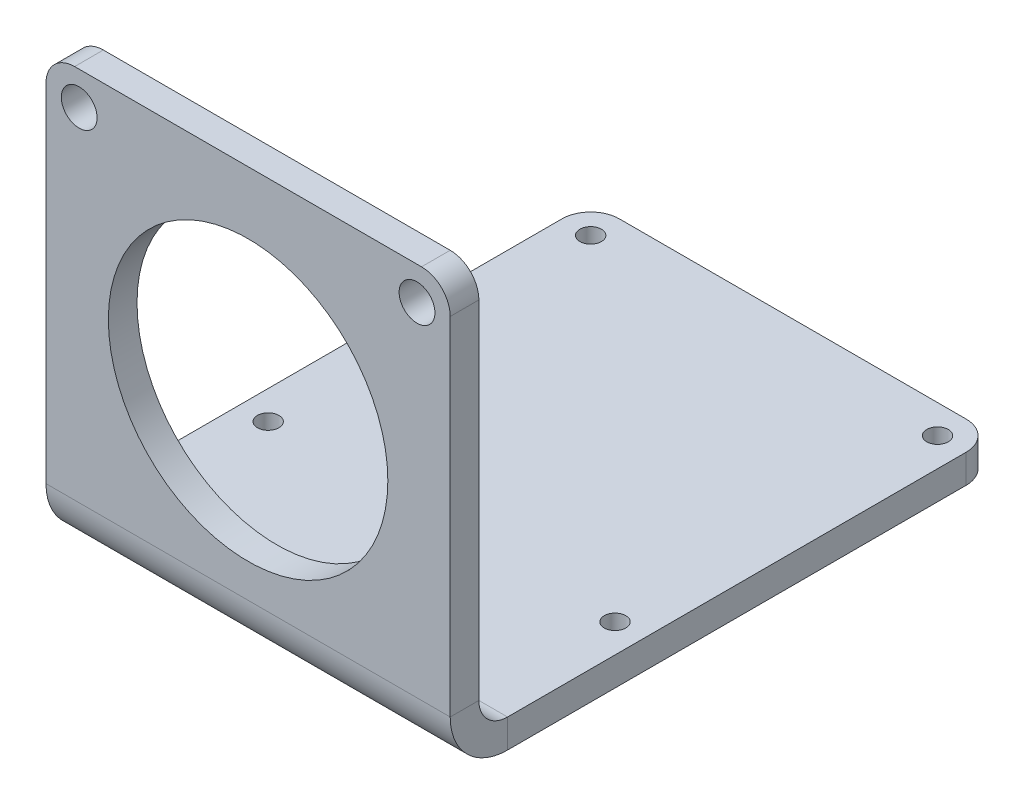
ISO-10303-21;
HEADER;
FILE_DESCRIPTION(('STEP AP214'),'2;1');
FILE_NAME('part.step','',(''),(''),'','','');
FILE_SCHEMA(('AUTOMOTIVE_DESIGN { 1 0 10303 214 1 1 1 1 }'));
ENDSEC;
DATA;
#1=APPLICATION_CONTEXT('core data for automotive mechanical design processes');
#2=APPLICATION_PROTOCOL_DEFINITION('international standard','automotive_design',2000,#1);
#3=PRODUCT_CONTEXT('',#1,'mechanical');
#4=PRODUCT('Part','Part','',(#3));
#5=PRODUCT_RELATED_PRODUCT_CATEGORY('part','',(#4));
#6=PRODUCT_DEFINITION_FORMATION('','',#4);
#7=PRODUCT_DEFINITION_CONTEXT('part definition',#1,'design');
#8=PRODUCT_DEFINITION('design','',#6,#7);
#9=PRODUCT_DEFINITION_SHAPE('','',#8);
#10=(LENGTH_UNIT() NAMED_UNIT(*) SI_UNIT(.MILLI.,.METRE.));
#11=(NAMED_UNIT(*) PLANE_ANGLE_UNIT() SI_UNIT($,.RADIAN.));
#12=(NAMED_UNIT(*) SI_UNIT($,.STERADIAN.) SOLID_ANGLE_UNIT());
#13=UNCERTAINTY_MEASURE_WITH_UNIT(LENGTH_MEASURE(1.E-05),#10,'distance_accuracy_value','');
#14=(GEOMETRIC_REPRESENTATION_CONTEXT(3) GLOBAL_UNCERTAINTY_ASSIGNED_CONTEXT((#13)) GLOBAL_UNIT_ASSIGNED_CONTEXT((#10,
#11,#12)) REPRESENTATION_CONTEXT('',''));
#15=CARTESIAN_POINT('',(0.,0.,0.));
#16=DIRECTION('',(0.,0.,1.));
#17=DIRECTION('',(1.,0.,0.));
#18=AXIS2_PLACEMENT_3D('',#15,#16,#17);
#19=CARTESIAN_POINT('',(28.2,-28.2,4.));
#20=DIRECTION('',(-1.,0.,0.));
#21=DIRECTION('',(0.,0.,1.));
#22=AXIS2_PLACEMENT_3D('',#19,#20,#21);
#23=PLANE('',#22);
#24=DIRECTION('',(0.,1.,0.));
#25=VECTOR('',#24,1.);
#26=CARTESIAN_POINT('',(28.2,-28.2,-4.));
#27=LINE('',#26,#25);
#28=CARTESIAN_POINT('',(28.2,-32.2,-4.));
#29=VERTEX_POINT('',#28);
#30=CARTESIAN_POINT('',(28.2,-28.2,-4.));
#31=VERTEX_POINT('',#30);
#32=EDGE_CURVE('E13',#29,#31,#27,.T.);
#33=ORIENTED_EDGE('',*,*,#32,.F.);
#34=DIRECTION('',(0.,0.,1.));
#35=VECTOR('',#34,1.);
#36=CARTESIAN_POINT('',(28.2,-32.2,4.));
#37=LINE('',#36,#35);
#38=CARTESIAN_POINT('',(28.2,-32.2,-68.));
#39=VERTEX_POINT('',#38);
#40=EDGE_CURVE('E115',#39,#29,#37,.T.);
#41=ORIENTED_EDGE('',*,*,#40,.F.);
#42=DIRECTION('',(0.,1.,0.));
#43=VECTOR('',#42,1.);
#44=CARTESIAN_POINT('',(28.2,-28.2,-68.));
#45=LINE('',#44,#43);
#46=CARTESIAN_POINT('',(28.2,-28.2,-68.));
#47=VERTEX_POINT('',#46);
#48=EDGE_CURVE('E63',#39,#47,#45,.T.);
#49=ORIENTED_EDGE('',*,*,#48,.T.);
#50=DIRECTION('',(0.,0.,1.));
#51=VECTOR('',#50,1.);
#52=CARTESIAN_POINT('',(28.2,-28.2,4.));
#53=LINE('',#52,#51);
#54=EDGE_CURVE('E118',#47,#31,#53,.T.);
#55=ORIENTED_EDGE('',*,*,#54,.T.);
#56=EDGE_LOOP('',(#33,#41,#49,#55));
#57=FACE_BOUND('',#56,.T.);
#58=ADVANCED_FACE('F52',(#57),#23,.F.);
#59=CARTESIAN_POINT('',(24.2,-28.2,-68.));
#60=DIRECTION('',(0.,1.,0.));
#61=DIRECTION('',(0.,0.,1.));
#62=AXIS2_PLACEMENT_3D('',#59,#60,#61);
#63=CYLINDRICAL_SURFACE('',#62,4.);
#64=ORIENTED_EDGE('',*,*,#48,.F.);
#65=CARTESIAN_POINT('',(24.2,-32.2,-68.));
#66=DIRECTION('',(0.,1.,0.));
#67=DIRECTION('',(0.,0.,1.));
#68=AXIS2_PLACEMENT_3D('',#65,#66,#67);
#69=CIRCLE('',#68,4.);
#70=CARTESIAN_POINT('',(24.2,-32.2,-72.));
#71=VERTEX_POINT('',#70);
#72=EDGE_CURVE('E145',#39,#71,#69,.T.);
#73=ORIENTED_EDGE('',*,*,#72,.T.);
#74=DIRECTION('',(0.,1.,0.));
#75=VECTOR('',#74,1.);
#76=CARTESIAN_POINT('',(24.2,-28.2,-72.));
#77=LINE('',#76,#75);
#78=CARTESIAN_POINT('',(24.2,-28.2,-72.));
#79=VERTEX_POINT('',#78);
#80=EDGE_CURVE('E204',#71,#79,#77,.T.);
#81=ORIENTED_EDGE('',*,*,#80,.T.);
#82=CARTESIAN_POINT('',(24.2,-28.2,-68.));
#83=DIRECTION('',(0.,1.,0.));
#84=DIRECTION('',(0.,0.,1.));
#85=AXIS2_PLACEMENT_3D('',#82,#83,#84);
#86=CIRCLE('',#85,4.);
#87=EDGE_CURVE('E219',#47,#79,#86,.T.);
#88=ORIENTED_EDGE('',*,*,#87,.F.);
#89=EDGE_LOOP('',(#64,#73,#81,#88));
#90=FACE_BOUND('',#89,.T.);
#91=ADVANCED_FACE('F226',(#90),#63,.T.);
#92=CARTESIAN_POINT('',(-28.2,-28.2,-72.));
#93=DIRECTION('',(0.,0.,1.));
#94=DIRECTION('',(1.,0.,0.));
#95=AXIS2_PLACEMENT_3D('',#92,#93,#94);
#96=PLANE('',#95);
#97=ORIENTED_EDGE('',*,*,#80,.F.);
#98=DIRECTION('',(1.,0.,0.));
#99=VECTOR('',#98,1.);
#100=CARTESIAN_POINT('',(-28.2,-32.2,-72.));
#101=LINE('',#100,#99);
#102=CARTESIAN_POINT('',(-24.2,-32.2,-72.));
#103=VERTEX_POINT('',#102);
#104=EDGE_CURVE('E327',#103,#71,#101,.T.);
#105=ORIENTED_EDGE('',*,*,#104,.F.);
#106=DIRECTION('',(0.,1.,0.));
#107=VECTOR('',#106,1.);
#108=CARTESIAN_POINT('',(-24.2,-28.2,-72.));
#109=LINE('',#108,#107);
#110=CARTESIAN_POINT('',(-24.2,-28.2,-72.));
#111=VERTEX_POINT('',#110);
#112=EDGE_CURVE('E200',#103,#111,#109,.T.);
#113=ORIENTED_EDGE('',*,*,#112,.T.);
#114=DIRECTION('',(1.,0.,0.));
#115=VECTOR('',#114,1.);
#116=CARTESIAN_POINT('',(-28.2,-28.2,-72.));
#117=LINE('',#116,#115);
#118=EDGE_CURVE('E228',#111,#79,#117,.T.);
#119=ORIENTED_EDGE('',*,*,#118,.T.);
#120=EDGE_LOOP('',(#97,#105,#113,#119));
#121=FACE_BOUND('',#120,.T.);
#122=ADVANCED_FACE('F395',(#121),#96,.F.);
#123=CARTESIAN_POINT('',(-24.2,-28.2,-68.));
#124=DIRECTION('',(0.,1.,0.));
#125=DIRECTION('',(0.,0.,1.));
#126=AXIS2_PLACEMENT_3D('',#123,#124,#125);
#127=CYLINDRICAL_SURFACE('',#126,4.);
#128=ORIENTED_EDGE('',*,*,#112,.F.);
#129=CARTESIAN_POINT('',(-24.2,-32.2,-68.));
#130=DIRECTION('',(0.,1.,0.));
#131=DIRECTION('',(0.,0.,1.));
#132=AXIS2_PLACEMENT_3D('',#129,#130,#131);
#133=CIRCLE('',#132,4.);
#134=CARTESIAN_POINT('',(-28.2,-32.2,-68.));
#135=VERTEX_POINT('',#134);
#136=EDGE_CURVE('E323',#103,#135,#133,.T.);
#137=ORIENTED_EDGE('',*,*,#136,.T.);
#138=DIRECTION('',(0.,1.,0.));
#139=VECTOR('',#138,1.);
#140=CARTESIAN_POINT('',(-28.2,-28.2,-68.));
#141=LINE('',#140,#139);
#142=CARTESIAN_POINT('',(-28.2,-28.2,-68.));
#143=VERTEX_POINT('',#142);
#144=EDGE_CURVE('E196',#135,#143,#141,.T.);
#145=ORIENTED_EDGE('',*,*,#144,.T.);
#146=CARTESIAN_POINT('',(-24.2,-28.2,-68.));
#147=DIRECTION('',(0.,1.,0.));
#148=DIRECTION('',(0.,0.,1.));
#149=AXIS2_PLACEMENT_3D('',#146,#147,#148);
#150=CIRCLE('',#149,4.);
#151=EDGE_CURVE('E232',#111,#143,#150,.T.);
#152=ORIENTED_EDGE('',*,*,#151,.F.);
#153=EDGE_LOOP('',(#128,#137,#145,#152));
#154=FACE_BOUND('',#153,.T.);
#155=ADVANCED_FACE('F470',(#154),#127,.T.);
#156=CARTESIAN_POINT('',(-28.2,-28.2,4.));
#157=DIRECTION('',(-1.,0.,0.));
#158=DIRECTION('',(0.,0.,1.));
#159=AXIS2_PLACEMENT_3D('',#156,#157,#158);
#160=PLANE('',#159);
#161=ORIENTED_EDGE('',*,*,#144,.F.);
#162=DIRECTION('',(0.,0.,1.));
#163=VECTOR('',#162,1.);
#164=CARTESIAN_POINT('',(-28.2,-32.2,4.));
#165=LINE('',#164,#163);
#166=CARTESIAN_POINT('',(-28.2,-32.2,-4.));
#167=VERTEX_POINT('',#166);
#168=EDGE_CURVE('E294',#135,#167,#165,.T.);
#169=ORIENTED_EDGE('',*,*,#168,.T.);
#170=DIRECTION('',(0.,1.,0.));
#171=VECTOR('',#170,1.);
#172=CARTESIAN_POINT('',(-28.2,-28.2,-4.));
#173=LINE('',#172,#171);
#174=CARTESIAN_POINT('',(-28.2,-28.2,-4.));
#175=VERTEX_POINT('',#174);
#176=EDGE_CURVE('E192',#167,#175,#173,.T.);
#177=ORIENTED_EDGE('',*,*,#176,.T.);
#178=DIRECTION('',(0.,0.,1.));
#179=VECTOR('',#178,1.);
#180=CARTESIAN_POINT('',(-28.2,-28.2,4.));
#181=LINE('',#180,#179);
#182=EDGE_CURVE('E239',#143,#175,#181,.T.);
#183=ORIENTED_EDGE('',*,*,#182,.F.);
#184=EDGE_LOOP('',(#161,#169,#177,#183));
#185=FACE_BOUND('',#184,.T.);
#186=ADVANCED_FACE('F467',(#185),#160,.T.);
#187=CARTESIAN_POINT('',(-28.2,-24.2,-4.));
#188=DIRECTION('',(1.,0.,0.));
#189=DIRECTION('',(0.,0.,-1.));
#190=AXIS2_PLACEMENT_3D('',#187,#188,#189);
#191=PLANE('',#190);
#192=ORIENTED_EDGE('',*,*,#176,.F.);
#193=CARTESIAN_POINT('',(-28.2,-24.2,-4.));
#194=DIRECTION('',(1.,0.,0.));
#195=DIRECTION('',(0.,0.,-1.));
#196=AXIS2_PLACEMENT_3D('',#193,#194,#195);
#197=CIRCLE('',#196,8.);
#198=CARTESIAN_POINT('',(-28.2,-24.2,4.));
#199=VERTEX_POINT('',#198);
#200=EDGE_CURVE('E133',#167,#199,#197,.F.);
#201=ORIENTED_EDGE('',*,*,#200,.T.);
#202=DIRECTION('',(0.,0.,-1.));
#203=VECTOR('',#202,1.);
#204=CARTESIAN_POINT('',(-28.2,-24.2,0.));
#205=LINE('',#204,#203);
#206=CARTESIAN_POINT('',(-28.2,-24.2,0.));
#207=VERTEX_POINT('',#206);
#208=EDGE_CURVE('E71',#199,#207,#205,.T.);
#209=ORIENTED_EDGE('',*,*,#208,.T.);
#210=CARTESIAN_POINT('',(-28.2,-24.2,-4.));
#211=DIRECTION('',(-1.,0.,0.));
#212=DIRECTION('',(0.,0.,1.));
#213=AXIS2_PLACEMENT_3D('',#210,#211,#212);
#214=CIRCLE('',#213,4.);
#215=EDGE_CURVE('E283',#175,#207,#214,.T.);
#216=ORIENTED_EDGE('',*,*,#215,.F.);
#217=EDGE_LOOP('',(#192,#201,#209,#216));
#218=FACE_BOUND('',#217,.T.);
#219=ADVANCED_FACE('F463',(#218),#191,.F.);
#220=CARTESIAN_POINT('',(-28.2,-28.2,0.));
#221=DIRECTION('',(-1.,0.,0.));
#222=DIRECTION('',(0.,-1.,0.));
#223=AXIS2_PLACEMENT_3D('',#220,#221,#222);
#224=PLANE('',#223);
#225=ORIENTED_EDGE('',*,*,#208,.F.);
#226=DIRECTION('',(0.,1.,0.));
#227=VECTOR('',#226,1.);
#228=CARTESIAN_POINT('',(-28.2,24.2,4.));
#229=LINE('',#228,#227);
#230=CARTESIAN_POINT('',(-28.2,24.2,4.));
#231=VERTEX_POINT('',#230);
#232=EDGE_CURVE('E306',#231,#199,#229,.F.);
#233=ORIENTED_EDGE('',*,*,#232,.F.);
#234=DIRECTION('',(0.,0.,-1.));
#235=VECTOR('',#234,1.);
#236=CARTESIAN_POINT('',(-28.2,24.2,0.));
#237=LINE('',#236,#235);
#238=CARTESIAN_POINT('',(-28.2,24.2,0.));
#239=VERTEX_POINT('',#238);
#240=EDGE_CURVE('E186',#231,#239,#237,.T.);
#241=ORIENTED_EDGE('',*,*,#240,.T.);
#242=DIRECTION('',(0.,-1.,0.));
#243=VECTOR('',#242,1.);
#244=CARTESIAN_POINT('',(-28.2,-28.2,0.));
#245=LINE('',#244,#243);
#246=EDGE_CURVE('E258',#239,#207,#245,.T.);
#247=ORIENTED_EDGE('',*,*,#246,.T.);
#248=EDGE_LOOP('',(#225,#233,#241,#247));
#249=FACE_BOUND('',#248,.T.);
#250=ADVANCED_FACE('F459',(#249),#224,.T.);
#251=CARTESIAN_POINT('',(-24.2,24.2,0.));
#252=DIRECTION('',(0.,0.,1.));
#253=DIRECTION('',(1.,0.,0.));
#254=AXIS2_PLACEMENT_3D('',#251,#252,#253);
#255=CYLINDRICAL_SURFACE('',#254,4.);
#256=ORIENTED_EDGE('',*,*,#240,.F.);
#257=CARTESIAN_POINT('',(-24.2,24.2,4.));
#258=DIRECTION('',(0.,0.,1.));
#259=DIRECTION('',(1.,0.,0.));
#260=AXIS2_PLACEMENT_3D('',#257,#258,#259);
#261=CIRCLE('',#260,4.);
#262=CARTESIAN_POINT('',(-24.2,28.2,4.));
#263=VERTEX_POINT('',#262);
#264=EDGE_CURVE('E314',#263,#231,#261,.T.);
#265=ORIENTED_EDGE('',*,*,#264,.F.);
#266=DIRECTION('',(0.,0.,-1.));
#267=VECTOR('',#266,1.);
#268=CARTESIAN_POINT('',(-24.2,28.2,0.));
#269=LINE('',#268,#267);
#270=CARTESIAN_POINT('',(-24.2,28.2,0.));
#271=VERTEX_POINT('',#270);
#272=EDGE_CURVE('E182',#263,#271,#269,.T.);
#273=ORIENTED_EDGE('',*,*,#272,.T.);
#274=CARTESIAN_POINT('',(-24.2,24.2,0.));
#275=DIRECTION('',(0.,0.,1.));
#276=DIRECTION('',(1.,0.,0.));
#277=AXIS2_PLACEMENT_3D('',#274,#275,#276);
#278=CIRCLE('',#277,4.);
#279=EDGE_CURVE('E262',#271,#239,#278,.T.);
#280=ORIENTED_EDGE('',*,*,#279,.T.);
#281=EDGE_LOOP('',(#256,#265,#273,#280));
#282=FACE_BOUND('',#281,.T.);
#283=ADVANCED_FACE('F455',(#282),#255,.T.);
#284=CARTESIAN_POINT('',(24.2,28.2,0.));
#285=DIRECTION('',(0.,1.,0.));
#286=DIRECTION('',(-1.,0.,0.));
#287=AXIS2_PLACEMENT_3D('',#284,#285,#286);
#288=PLANE('',#287);
#289=ORIENTED_EDGE('',*,*,#272,.F.);
#290=DIRECTION('',(1.,0.,0.));
#291=VECTOR('',#290,1.);
#292=CARTESIAN_POINT('',(24.2,28.2,4.));
#293=LINE('',#292,#291);
#294=CARTESIAN_POINT('',(24.2,28.2,4.));
#295=VERTEX_POINT('',#294);
#296=EDGE_CURVE('E310',#295,#263,#293,.F.);
#297=ORIENTED_EDGE('',*,*,#296,.F.);
#298=DIRECTION('',(0.,0.,-1.));
#299=VECTOR('',#298,1.);
#300=CARTESIAN_POINT('',(24.2,28.2,0.));
#301=LINE('',#300,#299);
#302=CARTESIAN_POINT('',(24.2,28.2,0.));
#303=VERTEX_POINT('',#302);
#304=EDGE_CURVE('E178',#295,#303,#301,.T.);
#305=ORIENTED_EDGE('',*,*,#304,.T.);
#306=DIRECTION('',(-1.,0.,0.));
#307=VECTOR('',#306,1.);
#308=CARTESIAN_POINT('',(24.2,28.2,0.));
#309=LINE('',#308,#307);
#310=EDGE_CURVE('E266',#303,#271,#309,.T.);
#311=ORIENTED_EDGE('',*,*,#310,.T.);
#312=EDGE_LOOP('',(#289,#297,#305,#311));
#313=FACE_BOUND('',#312,.T.);
#314=ADVANCED_FACE('F451',(#313),#288,.T.);
#315=CARTESIAN_POINT('',(24.2,24.2,0.));
#316=DIRECTION('',(0.,0.,1.));
#317=DIRECTION('',(1.,0.,0.));
#318=AXIS2_PLACEMENT_3D('',#315,#316,#317);
#319=CYLINDRICAL_SURFACE('',#318,4.);
#320=ORIENTED_EDGE('',*,*,#304,.F.);
#321=CARTESIAN_POINT('',(24.2,24.2,4.));
#322=DIRECTION('',(0.,0.,1.));
#323=DIRECTION('',(1.,0.,0.));
#324=AXIS2_PLACEMENT_3D('',#321,#322,#323);
#325=CIRCLE('',#324,4.);
#326=CARTESIAN_POINT('',(28.2,24.2,4.));
#327=VERTEX_POINT('',#326);
#328=EDGE_CURVE('E139',#327,#295,#325,.T.);
#329=ORIENTED_EDGE('',*,*,#328,.F.);
#330=DIRECTION('',(0.,0.,-1.));
#331=VECTOR('',#330,1.);
#332=CARTESIAN_POINT('',(28.2,24.2,0.));
#333=LINE('',#332,#331);
#334=CARTESIAN_POINT('',(28.2,24.2,0.));
#335=VERTEX_POINT('',#334);
#336=EDGE_CURVE('E174',#327,#335,#333,.T.);
#337=ORIENTED_EDGE('',*,*,#336,.T.);
#338=CARTESIAN_POINT('',(24.2,24.2,0.));
#339=DIRECTION('',(0.,0.,1.));
#340=DIRECTION('',(1.,0.,0.));
#341=AXIS2_PLACEMENT_3D('',#338,#339,#340);
#342=CIRCLE('',#341,4.);
#343=EDGE_CURVE('E270',#335,#303,#342,.T.);
#344=ORIENTED_EDGE('',*,*,#343,.T.);
#345=EDGE_LOOP('',(#320,#329,#337,#344));
#346=FACE_BOUND('',#345,.T.);
#347=ADVANCED_FACE('F447',(#346),#319,.T.);
#348=CARTESIAN_POINT('',(28.2,-28.2,0.));
#349=DIRECTION('',(1.,0.,0.));
#350=DIRECTION('',(0.,1.,0.));
#351=AXIS2_PLACEMENT_3D('',#348,#349,#350);
#352=PLANE('',#351);
#353=ORIENTED_EDGE('',*,*,#336,.F.);
#354=DIRECTION('',(0.,1.,0.));
#355=VECTOR('',#354,1.);
#356=CARTESIAN_POINT('',(28.2,24.2,4.));
#357=LINE('',#356,#355);
#358=CARTESIAN_POINT('',(28.2,-24.2,4.));
#359=VERTEX_POINT('',#358);
#360=EDGE_CURVE('E302',#359,#327,#357,.T.);
#361=ORIENTED_EDGE('',*,*,#360,.F.);
#362=DIRECTION('',(0.,0.,-1.));
#363=VECTOR('',#362,1.);
#364=CARTESIAN_POINT('',(28.2,-24.2,0.));
#365=LINE('',#364,#363);
#366=CARTESIAN_POINT('',(28.2,-24.2,0.));
#367=VERTEX_POINT('',#366);
#368=EDGE_CURVE('E56',#359,#367,#365,.T.);
#369=ORIENTED_EDGE('',*,*,#368,.T.);
#370=DIRECTION('',(0.,1.,0.));
#371=VECTOR('',#370,1.);
#372=CARTESIAN_POINT('',(28.2,-28.2,0.));
#373=LINE('',#372,#371);
#374=EDGE_CURVE('E254',#367,#335,#373,.T.);
#375=ORIENTED_EDGE('',*,*,#374,.T.);
#376=EDGE_LOOP('',(#353,#361,#369,#375));
#377=FACE_BOUND('',#376,.T.);
#378=ADVANCED_FACE('F406',(#377),#352,.T.);
#379=CARTESIAN_POINT('',(24.2,-28.2,-68.));
#380=DIRECTION('',(0.,1.,0.));
#381=DIRECTION('',(0.,0.,1.));
#382=AXIS2_PLACEMENT_3D('',#379,#380,#381);
#383=CYLINDRICAL_SURFACE('',#382,1.5);
#384=CARTESIAN_POINT('',(24.2,-28.2,-68.));
#385=DIRECTION('',(0.,1.,0.));
#386=DIRECTION('',(0.,0.,1.));
#387=AXIS2_PLACEMENT_3D('',#384,#385,#386);
#388=CIRCLE('',#387,1.5);
#389=CARTESIAN_POINT('',(24.2,-28.2,-66.5));
#390=VERTEX_POINT('',#389);
#391=EDGE_CURVE('E286',#390,#390,#388,.T.);
#392=ORIENTED_EDGE('',*,*,#391,.T.);
#393=EDGE_LOOP('',(#392));
#394=FACE_BOUND('',#393,.T.);
#395=CARTESIAN_POINT('',(24.2,-32.2,-68.));
#396=DIRECTION('',(0.,1.,0.));
#397=DIRECTION('',(0.,0.,1.));
#398=AXIS2_PLACEMENT_3D('',#395,#396,#397);
#399=CIRCLE('',#398,1.5);
#400=CARTESIAN_POINT('',(24.2,-32.2,-66.5));
#401=VERTEX_POINT('',#400);
#402=EDGE_CURVE('E156',#401,#401,#399,.T.);
#403=ORIENTED_EDGE('',*,*,#402,.F.);
#404=EDGE_LOOP('',(#403));
#405=FACE_BOUND('',#404,.T.);
#406=ADVANCED_FACE('F402',(#394,#405),#383,.F.);
#407=CARTESIAN_POINT('',(-24.2,-28.2,-23.));
#408=DIRECTION('',(0.,1.,0.));
#409=DIRECTION('',(0.,0.,1.));
#410=AXIS2_PLACEMENT_3D('',#407,#408,#409);
#411=CYLINDRICAL_SURFACE('',#410,1.5);
#412=CARTESIAN_POINT('',(-24.2,-28.2,-23.));
#413=DIRECTION('',(0.,1.,0.));
#414=DIRECTION('',(0.,0.,1.));
#415=AXIS2_PLACEMENT_3D('',#412,#413,#414);
#416=CIRCLE('',#415,1.5);
#417=CARTESIAN_POINT('',(-24.2,-28.2,-21.5));
#418=VERTEX_POINT('',#417);
#419=EDGE_CURVE('E356',#418,#418,#416,.T.);
#420=ORIENTED_EDGE('',*,*,#419,.T.);
#421=EDGE_LOOP('',(#420));
#422=FACE_BOUND('',#421,.T.);
#423=CARTESIAN_POINT('',(-24.2,-32.2,-23.));
#424=DIRECTION('',(0.,1.,0.));
#425=DIRECTION('',(0.,0.,1.));
#426=AXIS2_PLACEMENT_3D('',#423,#424,#425);
#427=CIRCLE('',#426,1.5);
#428=CARTESIAN_POINT('',(-24.2,-32.2,-21.5));
#429=VERTEX_POINT('',#428);
#430=EDGE_CURVE('E163',#429,#429,#427,.T.);
#431=ORIENTED_EDGE('',*,*,#430,.F.);
#432=EDGE_LOOP('',(#431));
#433=FACE_BOUND('',#432,.T.);
#434=ADVANCED_FACE('F405',(#422,#433),#411,.F.);
#435=CARTESIAN_POINT('',(24.2,-28.2,-23.));
#436=DIRECTION('',(0.,1.,0.));
#437=DIRECTION('',(0.,0.,1.));
#438=AXIS2_PLACEMENT_3D('',#435,#436,#437);
#439=CYLINDRICAL_SURFACE('',#438,1.5);
#440=CARTESIAN_POINT('',(24.2,-28.2,-23.));
#441=DIRECTION('',(0.,1.,0.));
#442=DIRECTION('',(0.,0.,1.));
#443=AXIS2_PLACEMENT_3D('',#440,#441,#442);
#444=CIRCLE('',#443,1.5);
#445=CARTESIAN_POINT('',(24.2,-28.2,-21.5));
#446=VERTEX_POINT('',#445);
#447=EDGE_CURVE('E361',#446,#446,#444,.T.);
#448=ORIENTED_EDGE('',*,*,#447,.T.);
#449=EDGE_LOOP('',(#448));
#450=FACE_BOUND('',#449,.T.);
#451=CARTESIAN_POINT('',(24.2,-32.2,-23.));
#452=DIRECTION('',(0.,1.,0.));
#453=DIRECTION('',(0.,0.,1.));
#454=AXIS2_PLACEMENT_3D('',#451,#452,#453);
#455=CIRCLE('',#454,1.5);
#456=CARTESIAN_POINT('',(24.2,-32.2,-21.5));
#457=VERTEX_POINT('',#456);
#458=EDGE_CURVE('E167',#457,#457,#455,.T.);
#459=ORIENTED_EDGE('',*,*,#458,.F.);
#460=EDGE_LOOP('',(#459));
#461=FACE_BOUND('',#460,.T.);
#462=ADVANCED_FACE('F409',(#450,#461),#439,.F.);
#463=CARTESIAN_POINT('',(-24.2,-28.2,-68.));
#464=DIRECTION('',(0.,1.,0.));
#465=DIRECTION('',(0.,0.,1.));
#466=AXIS2_PLACEMENT_3D('',#463,#464,#465);
#467=CYLINDRICAL_SURFACE('',#466,1.5);
#468=CARTESIAN_POINT('',(-24.2,-28.2,-68.));
#469=DIRECTION('',(0.,1.,0.));
#470=DIRECTION('',(0.,0.,1.));
#471=AXIS2_PLACEMENT_3D('',#468,#469,#470);
#472=CIRCLE('',#471,1.5);
#473=CARTESIAN_POINT('',(-24.2,-28.2,-66.5));
#474=VERTEX_POINT('',#473);
#475=EDGE_CURVE('E224',#474,#474,#472,.T.);
#476=ORIENTED_EDGE('',*,*,#475,.T.);
#477=EDGE_LOOP('',(#476));
#478=FACE_BOUND('',#477,.T.);
#479=CARTESIAN_POINT('',(-24.2,-32.2,-68.));
#480=DIRECTION('',(0.,1.,0.));
#481=DIRECTION('',(0.,0.,1.));
#482=AXIS2_PLACEMENT_3D('',#479,#480,#481);
#483=CIRCLE('',#482,1.5);
#484=CARTESIAN_POINT('',(-24.2,-32.2,-66.5));
#485=VERTEX_POINT('',#484);
#486=EDGE_CURVE('E147',#485,#485,#483,.T.);
#487=ORIENTED_EDGE('',*,*,#486,.F.);
#488=EDGE_LOOP('',(#487));
#489=FACE_BOUND('',#488,.T.);
#490=ADVANCED_FACE('F54',(#478,#489),#467,.F.);
#491=CARTESIAN_POINT('',(-23.57,23.57,0.));
#492=DIRECTION('',(0.,0.,1.));
#493=DIRECTION('',(1.,0.,0.));
#494=AXIS2_PLACEMENT_3D('',#491,#492,#493);
#495=CYLINDRICAL_SURFACE('',#494,2.5);
#496=CARTESIAN_POINT('',(-23.57,23.57,0.));
#497=DIRECTION('',(0.,0.,1.));
#498=DIRECTION('',(1.,0.,0.));
#499=AXIS2_PLACEMENT_3D('',#496,#497,#498);
#500=CIRCLE('',#499,2.5);
#501=CARTESIAN_POINT('',(-21.07,23.57,0.));
#502=VERTEX_POINT('',#501);
#503=EDGE_CURVE('E242',#502,#502,#500,.T.);
#504=ORIENTED_EDGE('',*,*,#503,.F.);
#505=EDGE_LOOP('',(#504));
#506=FACE_BOUND('',#505,.T.);
#507=CARTESIAN_POINT('',(-23.57,23.57,4.));
#508=DIRECTION('',(0.,0.,1.));
#509=DIRECTION('',(1.,0.,0.));
#510=AXIS2_PLACEMENT_3D('',#507,#508,#509);
#511=CIRCLE('',#510,2.5);
#512=CARTESIAN_POINT('',(-21.07,23.57,4.));
#513=VERTEX_POINT('',#512);
#514=EDGE_CURVE('E289',#513,#513,#511,.T.);
#515=ORIENTED_EDGE('',*,*,#514,.T.);
#516=EDGE_LOOP('',(#515));
#517=FACE_BOUND('',#516,.T.);
#518=ADVANCED_FACE('F416',(#506,#517),#495,.F.);
#519=CARTESIAN_POINT('',(23.57,23.57,0.));
#520=DIRECTION('',(0.,0.,1.));
#521=DIRECTION('',(1.,0.,0.));
#522=AXIS2_PLACEMENT_3D('',#519,#520,#521);
#523=CYLINDRICAL_SURFACE('',#522,2.5);
#524=CARTESIAN_POINT('',(23.57,23.57,0.));
#525=DIRECTION('',(0.,0.,1.));
#526=DIRECTION('',(1.,0.,0.));
#527=AXIS2_PLACEMENT_3D('',#524,#525,#526);
#528=CIRCLE('',#527,2.5);
#529=CARTESIAN_POINT('',(26.07,23.57,0.));
#530=VERTEX_POINT('',#529);
#531=EDGE_CURVE('E246',#530,#530,#528,.T.);
#532=ORIENTED_EDGE('',*,*,#531,.F.);
#533=EDGE_LOOP('',(#532));
#534=FACE_BOUND('',#533,.T.);
#535=CARTESIAN_POINT('',(23.57,23.57,4.));
#536=DIRECTION('',(0.,0.,1.));
#537=DIRECTION('',(1.,0.,0.));
#538=AXIS2_PLACEMENT_3D('',#535,#536,#537);
#539=CIRCLE('',#538,2.5);
#540=CARTESIAN_POINT('',(26.07,23.57,4.));
#541=VERTEX_POINT('',#540);
#542=EDGE_CURVE('E293',#541,#541,#539,.T.);
#543=ORIENTED_EDGE('',*,*,#542,.T.);
#544=EDGE_LOOP('',(#543));
#545=FACE_BOUND('',#544,.T.);
#546=ADVANCED_FACE('F437',(#534,#545),#523,.F.);
#547=CARTESIAN_POINT('',(0.,0.,0.));
#548=DIRECTION('',(0.,0.,1.));
#549=DIRECTION('',(1.,0.,0.));
#550=AXIS2_PLACEMENT_3D('',#547,#548,#549);
#551=CYLINDRICAL_SURFACE('',#550,19.5);
#552=CARTESIAN_POINT('',(0.,0.,0.));
#553=DIRECTION('',(0.,0.,1.));
#554=DIRECTION('',(1.,0.,0.));
#555=AXIS2_PLACEMENT_3D('',#552,#553,#554);
#556=CIRCLE('',#555,19.5);
#557=CARTESIAN_POINT('',(19.5,0.,0.));
#558=VERTEX_POINT('',#557);
#559=EDGE_CURVE('E250',#558,#558,#556,.T.);
#560=ORIENTED_EDGE('',*,*,#559,.F.);
#561=EDGE_LOOP('',(#560));
#562=FACE_BOUND('',#561,.T.);
#563=CARTESIAN_POINT('',(0.,0.,4.));
#564=DIRECTION('',(0.,0.,1.));
#565=DIRECTION('',(1.,0.,0.));
#566=AXIS2_PLACEMENT_3D('',#563,#564,#565);
#567=CIRCLE('',#566,19.5);
#568=CARTESIAN_POINT('',(19.5,0.,4.));
#569=VERTEX_POINT('',#568);
#570=EDGE_CURVE('E298',#569,#569,#567,.T.);
#571=ORIENTED_EDGE('',*,*,#570,.T.);
#572=EDGE_LOOP('',(#571));
#573=FACE_BOUND('',#572,.T.);
#574=ADVANCED_FACE('F401',(#562,#573),#551,.F.);
#575=CARTESIAN_POINT('',(28.2,-24.2,-4.));
#576=DIRECTION('',(1.,0.,0.));
#577=DIRECTION('',(0.,0.,-1.));
#578=AXIS2_PLACEMENT_3D('',#575,#576,#577);
#579=PLANE('',#578);
#580=CARTESIAN_POINT('',(28.2,-24.2,-4.));
#581=DIRECTION('',(1.,0.,0.));
#582=DIRECTION('',(0.,0.,-1.));
#583=AXIS2_PLACEMENT_3D('',#580,#581,#582);
#584=CIRCLE('',#583,8.);
#585=EDGE_CURVE('E131',#359,#29,#584,.T.);
#586=ORIENTED_EDGE('',*,*,#585,.T.);
#587=ORIENTED_EDGE('',*,*,#32,.T.);
#588=CARTESIAN_POINT('',(28.2,-24.2,-4.));
#589=DIRECTION('',(-1.,0.,0.));
#590=DIRECTION('',(0.,0.,1.));
#591=AXIS2_PLACEMENT_3D('',#588,#589,#590);
#592=CIRCLE('',#591,4.);
#593=EDGE_CURVE('E280',#367,#31,#592,.F.);
#594=ORIENTED_EDGE('',*,*,#593,.F.);
#595=ORIENTED_EDGE('',*,*,#368,.F.);
#596=EDGE_LOOP('',(#586,#587,#594,#595));
#597=FACE_BOUND('',#596,.T.);
#598=ADVANCED_FACE('F150',(#597),#579,.T.);
#599=CARTESIAN_POINT('',(24.2,24.2,0.));
#600=DIRECTION('',(0.,0.,1.));
#601=DIRECTION('',(1.,0.,0.));
#602=AXIS2_PLACEMENT_3D('',#599,#600,#601);
#603=PLANE('',#602);
#604=ORIENTED_EDGE('',*,*,#503,.T.);
#605=EDGE_LOOP('',(#604));
#606=FACE_BOUND('',#605,.T.);
#607=ORIENTED_EDGE('',*,*,#531,.T.);
#608=EDGE_LOOP('',(#607));
#609=FACE_BOUND('',#608,.T.);
#610=ORIENTED_EDGE('',*,*,#559,.T.);
#611=EDGE_LOOP('',(#610));
#612=FACE_BOUND('',#611,.T.);
#613=ORIENTED_EDGE('',*,*,#374,.F.);
#614=DIRECTION('',(1.,0.,0.));
#615=VECTOR('',#614,1.);
#616=CARTESIAN_POINT('',(24.2,-24.2,0.));
#617=LINE('',#616,#615);
#618=EDGE_CURVE('E276',#367,#207,#617,.F.);
#619=ORIENTED_EDGE('',*,*,#618,.T.);
#620=ORIENTED_EDGE('',*,*,#246,.F.);
#621=ORIENTED_EDGE('',*,*,#279,.F.);
#622=ORIENTED_EDGE('',*,*,#310,.F.);
#623=ORIENTED_EDGE('',*,*,#343,.F.);
#624=EDGE_LOOP('',(#613,#619,#620,#621,#622,#623));
#625=FACE_BOUND('',#624,.T.);
#626=ADVANCED_FACE('F376',(#606,#609,#612,#625),#603,.F.);
#627=CARTESIAN_POINT('',(-28.2,-28.2,4.));
#628=DIRECTION('',(0.,1.,0.));
#629=DIRECTION('',(0.,0.,1.));
#630=AXIS2_PLACEMENT_3D('',#627,#628,#629);
#631=PLANE('',#630);
#632=ORIENTED_EDGE('',*,*,#391,.F.);
#633=EDGE_LOOP('',(#632));
#634=FACE_BOUND('',#633,.T.);
#635=ORIENTED_EDGE('',*,*,#419,.F.);
#636=EDGE_LOOP('',(#635));
#637=FACE_BOUND('',#636,.T.);
#638=ORIENTED_EDGE('',*,*,#447,.F.);
#639=EDGE_LOOP('',(#638));
#640=FACE_BOUND('',#639,.T.);
#641=ORIENTED_EDGE('',*,*,#475,.F.);
#642=EDGE_LOOP('',(#641));
#643=FACE_BOUND('',#642,.T.);
#644=ORIENTED_EDGE('',*,*,#182,.T.);
#645=DIRECTION('',(1.,0.,0.));
#646=VECTOR('',#645,1.);
#647=CARTESIAN_POINT('',(-28.2,-28.2,-4.));
#648=LINE('',#647,#646);
#649=EDGE_CURVE('E222',#175,#31,#648,.T.);
#650=ORIENTED_EDGE('',*,*,#649,.T.);
#651=ORIENTED_EDGE('',*,*,#54,.F.);
#652=ORIENTED_EDGE('',*,*,#87,.T.);
#653=ORIENTED_EDGE('',*,*,#118,.F.);
#654=ORIENTED_EDGE('',*,*,#151,.T.);
#655=EDGE_LOOP('',(#644,#650,#651,#652,#653,#654));
#656=FACE_BOUND('',#655,.T.);
#657=ADVANCED_FACE('F217',(#634,#637,#640,#643,#656),#631,.T.);
#658=CARTESIAN_POINT('',(-28.2,-24.2,-4.));
#659=DIRECTION('',(1.,0.,0.));
#660=DIRECTION('',(0.,0.,-1.));
#661=AXIS2_PLACEMENT_3D('',#658,#659,#660);
#662=CYLINDRICAL_SURFACE('',#661,4.);
#663=ORIENTED_EDGE('',*,*,#215,.T.);
#664=ORIENTED_EDGE('',*,*,#618,.F.);
#665=ORIENTED_EDGE('',*,*,#593,.T.);
#666=ORIENTED_EDGE('',*,*,#649,.F.);
#667=EDGE_LOOP('',(#663,#664,#665,#666));
#668=FACE_BOUND('',#667,.T.);
#669=ADVANCED_FACE('F375',(#668),#662,.F.);
#670=CARTESIAN_POINT('',(24.2,24.2,4.));
#671=DIRECTION('',(0.,0.,1.));
#672=DIRECTION('',(1.,0.,0.));
#673=AXIS2_PLACEMENT_3D('',#670,#671,#672);
#674=PLANE('',#673);
#675=ORIENTED_EDGE('',*,*,#514,.F.);
#676=EDGE_LOOP('',(#675));
#677=FACE_BOUND('',#676,.T.);
#678=ORIENTED_EDGE('',*,*,#542,.F.);
#679=EDGE_LOOP('',(#678));
#680=FACE_BOUND('',#679,.T.);
#681=ORIENTED_EDGE('',*,*,#570,.F.);
#682=EDGE_LOOP('',(#681));
#683=FACE_BOUND('',#682,.T.);
#684=ORIENTED_EDGE('',*,*,#360,.T.);
#685=ORIENTED_EDGE('',*,*,#328,.T.);
#686=ORIENTED_EDGE('',*,*,#296,.T.);
#687=ORIENTED_EDGE('',*,*,#264,.T.);
#688=ORIENTED_EDGE('',*,*,#232,.T.);
#689=DIRECTION('',(1.,0.,0.));
#690=VECTOR('',#689,1.);
#691=CARTESIAN_POINT('',(24.2,-24.2,4.));
#692=LINE('',#691,#690);
#693=EDGE_CURVE('E138',#359,#199,#692,.F.);
#694=ORIENTED_EDGE('',*,*,#693,.F.);
#695=EDGE_LOOP('',(#684,#685,#686,#687,#688,#694));
#696=FACE_BOUND('',#695,.T.);
#697=ADVANCED_FACE('F383',(#677,#680,#683,#696),#674,.T.);
#698=CARTESIAN_POINT('',(-28.2,-32.2,4.));
#699=DIRECTION('',(0.,1.,0.));
#700=DIRECTION('',(0.,0.,1.));
#701=AXIS2_PLACEMENT_3D('',#698,#699,#700);
#702=PLANE('',#701);
#703=ORIENTED_EDGE('',*,*,#402,.T.);
#704=EDGE_LOOP('',(#703));
#705=FACE_BOUND('',#704,.T.);
#706=ORIENTED_EDGE('',*,*,#430,.T.);
#707=EDGE_LOOP('',(#706));
#708=FACE_BOUND('',#707,.T.);
#709=ORIENTED_EDGE('',*,*,#458,.T.);
#710=EDGE_LOOP('',(#709));
#711=FACE_BOUND('',#710,.T.);
#712=ORIENTED_EDGE('',*,*,#486,.T.);
#713=EDGE_LOOP('',(#712));
#714=FACE_BOUND('',#713,.T.);
#715=ORIENTED_EDGE('',*,*,#168,.F.);
#716=ORIENTED_EDGE('',*,*,#136,.F.);
#717=ORIENTED_EDGE('',*,*,#104,.T.);
#718=ORIENTED_EDGE('',*,*,#72,.F.);
#719=ORIENTED_EDGE('',*,*,#40,.T.);
#720=DIRECTION('',(1.,0.,0.));
#721=VECTOR('',#720,1.);
#722=CARTESIAN_POINT('',(-28.2,-32.2,-4.));
#723=LINE('',#722,#721);
#724=EDGE_CURVE('E128',#167,#29,#723,.T.);
#725=ORIENTED_EDGE('',*,*,#724,.F.);
#726=EDGE_LOOP('',(#715,#716,#717,#718,#719,#725));
#727=FACE_BOUND('',#726,.T.);
#728=ADVANCED_FACE('F142',(#705,#708,#711,#714,#727),#702,.F.);
#729=CARTESIAN_POINT('',(-28.2,-24.2,-4.));
#730=DIRECTION('',(1.,0.,0.));
#731=DIRECTION('',(0.,0.,-1.));
#732=AXIS2_PLACEMENT_3D('',#729,#730,#731);
#733=CYLINDRICAL_SURFACE('',#732,8.);
#734=ORIENTED_EDGE('',*,*,#200,.F.);
#735=ORIENTED_EDGE('',*,*,#724,.T.);
#736=ORIENTED_EDGE('',*,*,#585,.F.);
#737=ORIENTED_EDGE('',*,*,#693,.T.);
#738=EDGE_LOOP('',(#734,#735,#736,#737));
#739=FACE_BOUND('',#738,.T.);
#740=ADVANCED_FACE('F129',(#739),#733,.T.);
#741=CLOSED_SHELL('',(#58,#91,#122,#155,#186,#219,#250,#283,#314,#347,#378,#406,#434,#462,#490,
#518,#546,#574,#598,#626,#657,#669,#697,#728,#740));
#742=MANIFOLD_SOLID_BREP('B2',#741);
#743=ADVANCED_BREP_SHAPE_REPRESENTATION('',(#18,#742),#14);
#744=SHAPE_DEFINITION_REPRESENTATION(#9,#743);
ENDSEC;
END-ISO-10303-21;
